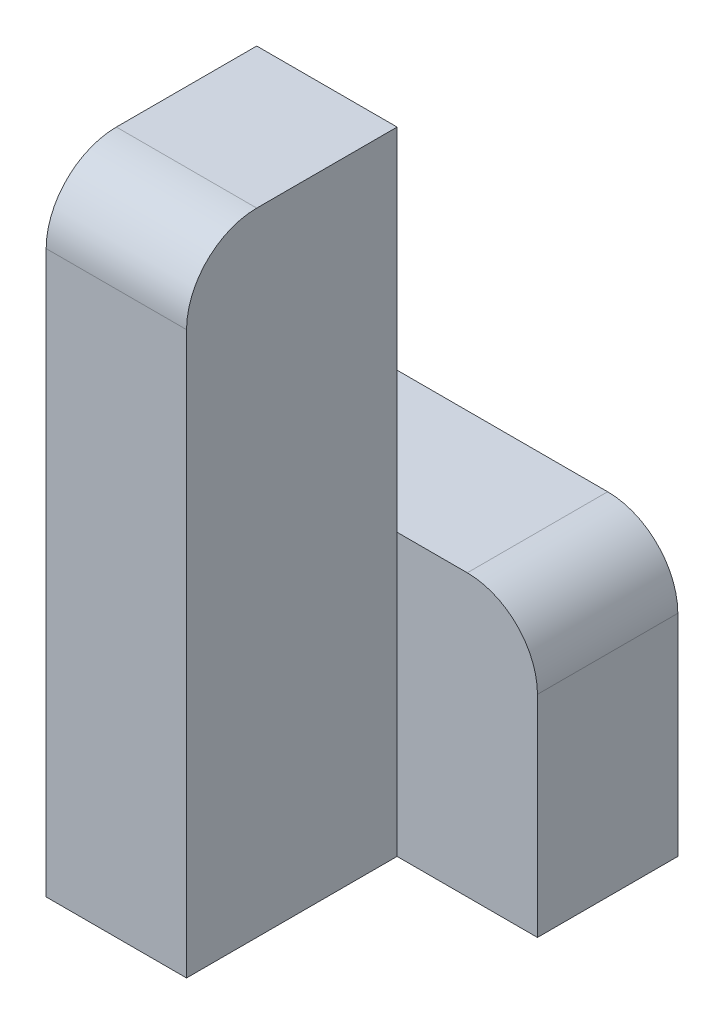
ISO-10303-21;
HEADER;
FILE_DESCRIPTION(('STEP AP214'),'2;1');
FILE_NAME('part.step','',(''),(''),'','','');
FILE_SCHEMA(('AUTOMOTIVE_DESIGN { 1 0 10303 214 1 1 1 1 }'));
ENDSEC;
DATA;
#1=APPLICATION_CONTEXT('core data for automotive mechanical design processes');
#2=APPLICATION_PROTOCOL_DEFINITION('international standard','automotive_design',2000,#1);
#3=PRODUCT_CONTEXT('',#1,'mechanical');
#4=PRODUCT('Part','Part','',(#3));
#5=PRODUCT_RELATED_PRODUCT_CATEGORY('part','',(#4));
#6=PRODUCT_DEFINITION_FORMATION('','',#4);
#7=PRODUCT_DEFINITION_CONTEXT('part definition',#1,'design');
#8=PRODUCT_DEFINITION('design','',#6,#7);
#9=PRODUCT_DEFINITION_SHAPE('','',#8);
#10=(LENGTH_UNIT() NAMED_UNIT(*) SI_UNIT(.MILLI.,.METRE.));
#11=(NAMED_UNIT(*) PLANE_ANGLE_UNIT() SI_UNIT($,.RADIAN.));
#12=(NAMED_UNIT(*) SI_UNIT($,.STERADIAN.) SOLID_ANGLE_UNIT());
#13=UNCERTAINTY_MEASURE_WITH_UNIT(LENGTH_MEASURE(1.E-05),#10,'distance_accuracy_value','');
#14=(GEOMETRIC_REPRESENTATION_CONTEXT(3) GLOBAL_UNCERTAINTY_ASSIGNED_CONTEXT((#13)) GLOBAL_UNIT_ASSIGNED_CONTEXT((#10,
#11,#12)) REPRESENTATION_CONTEXT('',''));
#15=CARTESIAN_POINT('',(0.,0.,0.));
#16=DIRECTION('',(0.,0.,1.));
#17=DIRECTION('',(1.,0.,0.));
#18=AXIS2_PLACEMENT_3D('',#15,#16,#17);
#19=CARTESIAN_POINT('',(-10.,0.,30.));
#20=DIRECTION('',(0.,-1.,0.));
#21=DIRECTION('',(1.,0.,0.));
#22=AXIS2_PLACEMENT_3D('',#19,#20,#21);
#23=PLANE('',#22);
#24=DIRECTION('',(0.,0.,-1.));
#25=VECTOR('',#24,1.);
#26=CARTESIAN_POINT('',(-30.,0.,30.));
#27=LINE('',#26,#25);
#28=CARTESIAN_POINT('',(-30.,0.,20.));
#29=VERTEX_POINT('',#28);
#30=CARTESIAN_POINT('',(-30.,0.,0.));
#31=VERTEX_POINT('',#30);
#32=EDGE_CURVE('E171',#29,#31,#27,.T.);
#33=ORIENTED_EDGE('',*,*,#32,.F.);
#34=DIRECTION('',(-1.,0.,0.));
#35=VECTOR('',#34,1.);
#36=CARTESIAN_POINT('',(-10.,0.,20.));
#37=LINE('',#36,#35);
#38=CARTESIAN_POINT('',(-10.,0.,20.));
#39=VERTEX_POINT('',#38);
#40=EDGE_CURVE('E43',#29,#39,#37,.F.);
#41=ORIENTED_EDGE('',*,*,#40,.T.);
#42=DIRECTION('',(0.,0.,-1.));
#43=VECTOR('',#42,1.);
#44=CARTESIAN_POINT('',(-10.,0.,30.));
#45=LINE('',#44,#43);
#46=CARTESIAN_POINT('',(-10.,0.,0.));
#47=VERTEX_POINT('',#46);
#48=EDGE_CURVE('E158',#39,#47,#45,.T.);
#49=ORIENTED_EDGE('',*,*,#48,.T.);
#50=DIRECTION('',(-1.,0.,0.));
#51=VECTOR('',#50,1.);
#52=CARTESIAN_POINT('',(-10.,0.,0.));
#53=LINE('',#52,#51);
#54=EDGE_CURVE('E148',#47,#31,#53,.T.);
#55=ORIENTED_EDGE('',*,*,#54,.T.);
#56=EDGE_LOOP('',(#33,#41,#49,#55));
#57=FACE_BOUND('',#56,.T.);
#58=ADVANCED_FACE('F35',(#57),#23,.F.);
#59=CARTESIAN_POINT('',(-30.,0.,30.));
#60=DIRECTION('',(1.,0.,0.));
#61=DIRECTION('',(0.,0.,-1.));
#62=AXIS2_PLACEMENT_3D('',#59,#60,#61);
#63=PLANE('',#62);
#64=DIRECTION('',(0.,-1.,0.));
#65=VECTOR('',#64,1.);
#66=CARTESIAN_POINT('',(-30.,0.,30.));
#67=LINE('',#66,#65);
#68=CARTESIAN_POINT('',(-30.,-10.,30.));
#69=VERTEX_POINT('',#68);
#70=CARTESIAN_POINT('',(-30.,-90.,30.));
#71=VERTEX_POINT('',#70);
#72=EDGE_CURVE('E150',#69,#71,#67,.T.);
#73=ORIENTED_EDGE('',*,*,#72,.F.);
#74=CARTESIAN_POINT('',(-30.,-10.,20.));
#75=DIRECTION('',(1.,0.,0.));
#76=DIRECTION('',(0.,0.,-1.));
#77=AXIS2_PLACEMENT_3D('',#74,#75,#76);
#78=CIRCLE('',#77,10.);
#79=EDGE_CURVE('E57',#69,#29,#78,.F.);
#80=ORIENTED_EDGE('',*,*,#79,.T.);
#81=ORIENTED_EDGE('',*,*,#32,.T.);
#82=DIRECTION('',(0.,-1.,0.));
#83=VECTOR('',#82,1.);
#84=CARTESIAN_POINT('',(-30.,0.,0.));
#85=LINE('',#84,#83);
#86=CARTESIAN_POINT('',(-30.,-50.,0.));
#87=VERTEX_POINT('',#86);
#88=EDGE_CURVE('E126',#31,#87,#85,.T.);
#89=ORIENTED_EDGE('',*,*,#88,.T.);
#90=DIRECTION('',(0.,0.,1.));
#91=VECTOR('',#90,1.);
#92=CARTESIAN_POINT('',(-30.,-50.,-20.));
#93=LINE('',#92,#91);
#94=CARTESIAN_POINT('',(-30.,-50.,-20.));
#95=VERTEX_POINT('',#94);
#96=EDGE_CURVE('E111',#95,#87,#93,.T.);
#97=ORIENTED_EDGE('',*,*,#96,.F.);
#98=DIRECTION('',(0.,-1.,0.));
#99=VECTOR('',#98,1.);
#100=CARTESIAN_POINT('',(-30.,-50.,-20.));
#101=LINE('',#100,#99);
#102=CARTESIAN_POINT('',(-30.,-90.,-20.));
#103=VERTEX_POINT('',#102);
#104=EDGE_CURVE('E118',#95,#103,#101,.T.);
#105=ORIENTED_EDGE('',*,*,#104,.T.);
#106=DIRECTION('',(0.,0.,-1.));
#107=VECTOR('',#106,1.);
#108=CARTESIAN_POINT('',(-30.,-90.,30.));
#109=LINE('',#108,#107);
#110=EDGE_CURVE('E169',#71,#103,#109,.T.);
#111=ORIENTED_EDGE('',*,*,#110,.F.);
#112=EDGE_LOOP('',(#73,#80,#81,#89,#97,#105,#111));
#113=FACE_BOUND('',#112,.T.);
#114=ADVANCED_FACE('F123',(#113),#63,.F.);
#115=CARTESIAN_POINT('',(-30.,-90.,30.));
#116=DIRECTION('',(0.,1.,0.));
#117=DIRECTION('',(0.,0.,1.));
#118=AXIS2_PLACEMENT_3D('',#115,#116,#117);
#119=PLANE('',#118);
#120=ORIENTED_EDGE('',*,*,#110,.T.);
#121=DIRECTION('',(1.,0.,0.));
#122=VECTOR('',#121,1.);
#123=CARTESIAN_POINT('',(-30.,-90.,-20.));
#124=LINE('',#123,#122);
#125=CARTESIAN_POINT('',(10.,-90.,-20.));
#126=VERTEX_POINT('',#125);
#127=EDGE_CURVE('E134',#103,#126,#124,.T.);
#128=ORIENTED_EDGE('',*,*,#127,.T.);
#129=DIRECTION('',(0.,0.,1.));
#130=VECTOR('',#129,1.);
#131=CARTESIAN_POINT('',(10.,-90.,-20.));
#132=LINE('',#131,#130);
#133=CARTESIAN_POINT('',(10.,-90.,0.));
#134=VERTEX_POINT('',#133);
#135=EDGE_CURVE('E127',#126,#134,#132,.T.);
#136=ORIENTED_EDGE('',*,*,#135,.T.);
#137=DIRECTION('',(1.,0.,0.));
#138=VECTOR('',#137,1.);
#139=CARTESIAN_POINT('',(-30.,-90.,0.));
#140=LINE('',#139,#138);
#141=CARTESIAN_POINT('',(-10.,-90.,0.));
#142=VERTEX_POINT('',#141);
#143=EDGE_CURVE('E142',#142,#134,#140,.T.);
#144=ORIENTED_EDGE('',*,*,#143,.F.);
#145=DIRECTION('',(0.,0.,-1.));
#146=VECTOR('',#145,1.);
#147=CARTESIAN_POINT('',(-10.,-90.,30.));
#148=LINE('',#147,#146);
#149=CARTESIAN_POINT('',(-10.,-90.,30.));
#150=VERTEX_POINT('',#149);
#151=EDGE_CURVE('E166',#150,#142,#148,.T.);
#152=ORIENTED_EDGE('',*,*,#151,.F.);
#153=DIRECTION('',(1.,0.,0.));
#154=VECTOR('',#153,1.);
#155=CARTESIAN_POINT('',(-30.,-90.,30.));
#156=LINE('',#155,#154);
#157=EDGE_CURVE('E152',#71,#150,#156,.T.);
#158=ORIENTED_EDGE('',*,*,#157,.F.);
#159=EDGE_LOOP('',(#120,#128,#136,#144,#152,#158));
#160=FACE_BOUND('',#159,.T.);
#161=ADVANCED_FACE('F193',(#160),#119,.F.);
#162=CARTESIAN_POINT('',(-10.,-90.,30.));
#163=DIRECTION('',(-1.,0.,0.));
#164=DIRECTION('',(0.,0.,1.));
#165=AXIS2_PLACEMENT_3D('',#162,#163,#164);
#166=PLANE('',#165);
#167=ORIENTED_EDGE('',*,*,#48,.F.);
#168=CARTESIAN_POINT('',(-10.,-10.,20.));
#169=DIRECTION('',(-1.,0.,0.));
#170=DIRECTION('',(0.,0.,1.));
#171=AXIS2_PLACEMENT_3D('',#168,#169,#170);
#172=CIRCLE('',#171,10.);
#173=CARTESIAN_POINT('',(-10.,-10.,30.));
#174=VERTEX_POINT('',#173);
#175=EDGE_CURVE('E11',#39,#174,#172,.F.);
#176=ORIENTED_EDGE('',*,*,#175,.T.);
#177=DIRECTION('',(0.,1.,0.));
#178=VECTOR('',#177,1.);
#179=CARTESIAN_POINT('',(-10.,-90.,30.));
#180=LINE('',#179,#178);
#181=EDGE_CURVE('E155',#150,#174,#180,.T.);
#182=ORIENTED_EDGE('',*,*,#181,.F.);
#183=ORIENTED_EDGE('',*,*,#151,.T.);
#184=DIRECTION('',(0.,1.,0.));
#185=VECTOR('',#184,1.);
#186=CARTESIAN_POINT('',(-10.,-90.,0.));
#187=LINE('',#186,#185);
#188=CARTESIAN_POINT('',(-10.,-50.,0.));
#189=VERTEX_POINT('',#188);
#190=EDGE_CURVE('E153',#142,#189,#187,.T.);
#191=ORIENTED_EDGE('',*,*,#190,.T.);
#192=EDGE_CURVE('E162',#189,#47,#187,.T.);
#193=ORIENTED_EDGE('',*,*,#192,.T.);
#194=EDGE_LOOP('',(#167,#176,#182,#183,#191,#193));
#195=FACE_BOUND('',#194,.T.);
#196=ADVANCED_FACE('F196',(#195),#166,.F.);
#197=CARTESIAN_POINT('',(0.,0.,30.));
#198=DIRECTION('',(0.,0.,1.));
#199=DIRECTION('',(1.,0.,0.));
#200=AXIS2_PLACEMENT_3D('',#197,#198,#199);
#201=PLANE('',#200);
#202=ORIENTED_EDGE('',*,*,#181,.T.);
#203=DIRECTION('',(-1.,0.,0.));
#204=VECTOR('',#203,1.);
#205=CARTESIAN_POINT('',(-30.,-10.,30.));
#206=LINE('',#205,#204);
#207=EDGE_CURVE('E181',#174,#69,#206,.T.);
#208=ORIENTED_EDGE('',*,*,#207,.T.);
#209=ORIENTED_EDGE('',*,*,#72,.T.);
#210=ORIENTED_EDGE('',*,*,#157,.T.);
#211=EDGE_LOOP('',(#202,#208,#209,#210));
#212=FACE_BOUND('',#211,.T.);
#213=ADVANCED_FACE('F186',(#212),#201,.T.);
#214=CARTESIAN_POINT('',(0.,0.,0.));
#215=DIRECTION('',(0.,0.,1.));
#216=DIRECTION('',(1.,0.,0.));
#217=AXIS2_PLACEMENT_3D('',#214,#215,#216);
#218=PLANE('',#217);
#219=ORIENTED_EDGE('',*,*,#192,.F.);
#220=DIRECTION('',(-1.,0.,0.));
#221=VECTOR('',#220,1.);
#222=CARTESIAN_POINT('',(10.,-50.,0.));
#223=LINE('',#222,#221);
#224=EDGE_CURVE('E143',#189,#87,#223,.T.);
#225=ORIENTED_EDGE('',*,*,#224,.T.);
#226=ORIENTED_EDGE('',*,*,#88,.F.);
#227=ORIENTED_EDGE('',*,*,#54,.F.);
#228=EDGE_LOOP('',(#219,#225,#226,#227));
#229=FACE_BOUND('',#228,.T.);
#230=ADVANCED_FACE('F215',(#229),#218,.F.);
#231=CARTESIAN_POINT('',(0.,0.,0.));
#232=DIRECTION('',(0.,0.,1.));
#233=DIRECTION('',(1.,0.,0.));
#234=AXIS2_PLACEMENT_3D('',#231,#232,#233);
#235=PLANE('',#234);
#236=DIRECTION('',(0.,1.,0.));
#237=VECTOR('',#236,1.);
#238=CARTESIAN_POINT('',(10.,-90.,0.));
#239=LINE('',#238,#237);
#240=CARTESIAN_POINT('',(10.,-60.,0.));
#241=VERTEX_POINT('',#240);
#242=EDGE_CURVE('E119',#134,#241,#239,.T.);
#243=ORIENTED_EDGE('',*,*,#242,.T.);
#244=CARTESIAN_POINT('',(0.,-60.,0.));
#245=DIRECTION('',(0.,0.,1.));
#246=DIRECTION('',(1.,0.,0.));
#247=AXIS2_PLACEMENT_3D('',#244,#245,#246);
#248=CIRCLE('',#247,10.);
#249=CARTESIAN_POINT('',(0.,-50.,0.));
#250=VERTEX_POINT('',#249);
#251=EDGE_CURVE('E176',#241,#250,#248,.T.);
#252=ORIENTED_EDGE('',*,*,#251,.T.);
#253=EDGE_CURVE('E140',#250,#189,#223,.T.);
#254=ORIENTED_EDGE('',*,*,#253,.T.);
#255=ORIENTED_EDGE('',*,*,#190,.F.);
#256=ORIENTED_EDGE('',*,*,#143,.T.);
#257=EDGE_LOOP('',(#243,#252,#254,#255,#256));
#258=FACE_BOUND('',#257,.T.);
#259=ADVANCED_FACE('F218',(#258),#235,.T.);
#260=CARTESIAN_POINT('',(10.,-50.,-20.));
#261=DIRECTION('',(0.,1.,0.));
#262=DIRECTION('',(-1.,0.,0.));
#263=AXIS2_PLACEMENT_3D('',#260,#261,#262);
#264=PLANE('',#263);
#265=ORIENTED_EDGE('',*,*,#253,.F.);
#266=DIRECTION('',(0.,0.,1.));
#267=VECTOR('',#266,1.);
#268=CARTESIAN_POINT('',(0.,-50.,-20.));
#269=LINE('',#268,#267);
#270=CARTESIAN_POINT('',(0.,-50.,-20.));
#271=VERTEX_POINT('',#270);
#272=EDGE_CURVE('E114',#250,#271,#269,.F.);
#273=ORIENTED_EDGE('',*,*,#272,.T.);
#274=DIRECTION('',(-1.,0.,0.));
#275=VECTOR('',#274,1.);
#276=CARTESIAN_POINT('',(10.,-50.,-20.));
#277=LINE('',#276,#275);
#278=EDGE_CURVE('E106',#271,#95,#277,.T.);
#279=ORIENTED_EDGE('',*,*,#278,.T.);
#280=ORIENTED_EDGE('',*,*,#96,.T.);
#281=ORIENTED_EDGE('',*,*,#224,.F.);
#282=EDGE_LOOP('',(#265,#273,#279,#280,#281));
#283=FACE_BOUND('',#282,.T.);
#284=ADVANCED_FACE('F109',(#283),#264,.T.);
#285=CARTESIAN_POINT('',(10.,-90.,-20.));
#286=DIRECTION('',(1.,0.,0.));
#287=DIRECTION('',(0.,0.,-1.));
#288=AXIS2_PLACEMENT_3D('',#285,#286,#287);
#289=PLANE('',#288);
#290=DIRECTION('',(0.,1.,0.));
#291=VECTOR('',#290,1.);
#292=CARTESIAN_POINT('',(10.,-90.,-20.));
#293=LINE('',#292,#291);
#294=CARTESIAN_POINT('',(10.,-60.,-20.));
#295=VERTEX_POINT('',#294);
#296=EDGE_CURVE('E128',#126,#295,#293,.T.);
#297=ORIENTED_EDGE('',*,*,#296,.T.);
#298=DIRECTION('',(0.,0.,1.));
#299=VECTOR('',#298,1.);
#300=CARTESIAN_POINT('',(10.,-60.,-20.));
#301=LINE('',#300,#299);
#302=EDGE_CURVE('E173',#295,#241,#301,.T.);
#303=ORIENTED_EDGE('',*,*,#302,.T.);
#304=ORIENTED_EDGE('',*,*,#242,.F.);
#305=ORIENTED_EDGE('',*,*,#135,.F.);
#306=EDGE_LOOP('',(#297,#303,#304,#305));
#307=FACE_BOUND('',#306,.T.);
#308=ADVANCED_FACE('F224',(#307),#289,.T.);
#309=CARTESIAN_POINT('',(0.,0.,-20.));
#310=DIRECTION('',(0.,0.,1.));
#311=DIRECTION('',(1.,0.,0.));
#312=AXIS2_PLACEMENT_3D('',#309,#310,#311);
#313=PLANE('',#312);
#314=ORIENTED_EDGE('',*,*,#278,.F.);
#315=CARTESIAN_POINT('',(0.,-60.,-20.));
#316=DIRECTION('',(0.,0.,1.));
#317=DIRECTION('',(1.,0.,0.));
#318=AXIS2_PLACEMENT_3D('',#315,#316,#317);
#319=CIRCLE('',#318,10.);
#320=EDGE_CURVE('E179',#271,#295,#319,.F.);
#321=ORIENTED_EDGE('',*,*,#320,.T.);
#322=ORIENTED_EDGE('',*,*,#296,.F.);
#323=ORIENTED_EDGE('',*,*,#127,.F.);
#324=ORIENTED_EDGE('',*,*,#104,.F.);
#325=EDGE_LOOP('',(#314,#321,#322,#323,#324));
#326=FACE_BOUND('',#325,.T.);
#327=ADVANCED_FACE('F131',(#326),#313,.F.);
#328=CARTESIAN_POINT('',(0.,-60.,-20.));
#329=DIRECTION('',(0.,0.,1.));
#330=DIRECTION('',(1.,0.,0.));
#331=AXIS2_PLACEMENT_3D('',#328,#329,#330);
#332=CYLINDRICAL_SURFACE('',#331,10.);
#333=ORIENTED_EDGE('',*,*,#320,.F.);
#334=ORIENTED_EDGE('',*,*,#272,.F.);
#335=ORIENTED_EDGE('',*,*,#251,.F.);
#336=ORIENTED_EDGE('',*,*,#302,.F.);
#337=EDGE_LOOP('',(#333,#334,#335,#336));
#338=FACE_BOUND('',#337,.T.);
#339=ADVANCED_FACE('F199',(#338),#332,.T.);
#340=CARTESIAN_POINT('',(0.,-10.,20.));
#341=DIRECTION('',(1.,0.,0.));
#342=DIRECTION('',(0.,1.,0.));
#343=AXIS2_PLACEMENT_3D('',#340,#341,#342);
#344=CYLINDRICAL_SURFACE('',#343,10.);
#345=ORIENTED_EDGE('',*,*,#175,.F.);
#346=ORIENTED_EDGE('',*,*,#40,.F.);
#347=ORIENTED_EDGE('',*,*,#79,.F.);
#348=ORIENTED_EDGE('',*,*,#207,.F.);
#349=EDGE_LOOP('',(#345,#346,#347,#348));
#350=FACE_BOUND('',#349,.T.);
#351=ADVANCED_FACE('F37',(#350),#344,.T.);
#352=CLOSED_SHELL('',(#58,#114,#161,#196,#213,#230,#259,#284,#308,#327,#339,#351));
#353=MANIFOLD_SOLID_BREP('B2',#352);
#354=ADVANCED_BREP_SHAPE_REPRESENTATION('',(#18,#353),#14);
#355=SHAPE_DEFINITION_REPRESENTATION(#9,#354);
ENDSEC;
END-ISO-10303-21;
